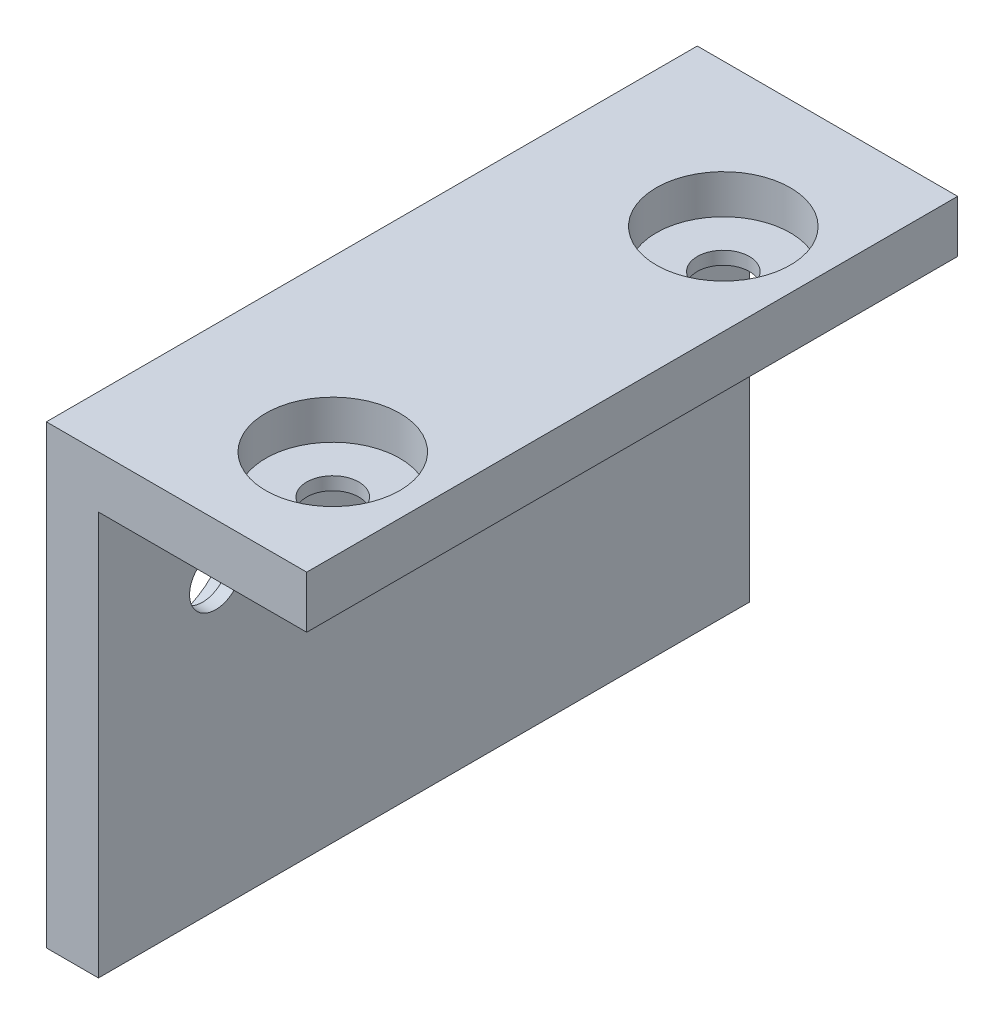
ISO-10303-21;
HEADER;
FILE_DESCRIPTION(('STEP AP214'),'2;1');
FILE_NAME('part.step','',(''),(''),'','','');
FILE_SCHEMA(('AUTOMOTIVE_DESIGN { 1 0 10303 214 1 1 1 1 }'));
ENDSEC;
DATA;
#1=APPLICATION_CONTEXT('core data for automotive mechanical design processes');
#2=APPLICATION_PROTOCOL_DEFINITION('international standard','automotive_design',2000,#1);
#3=PRODUCT_CONTEXT('',#1,'mechanical');
#4=PRODUCT('Part','Part','',(#3));
#5=PRODUCT_RELATED_PRODUCT_CATEGORY('part','',(#4));
#6=PRODUCT_DEFINITION_FORMATION('','',#4);
#7=PRODUCT_DEFINITION_CONTEXT('part definition',#1,'design');
#8=PRODUCT_DEFINITION('design','',#6,#7);
#9=PRODUCT_DEFINITION_SHAPE('','',#8);
#10=(LENGTH_UNIT() NAMED_UNIT(*) SI_UNIT(.MILLI.,.METRE.));
#11=(NAMED_UNIT(*) PLANE_ANGLE_UNIT() SI_UNIT($,.RADIAN.));
#12=(NAMED_UNIT(*) SI_UNIT($,.STERADIAN.) SOLID_ANGLE_UNIT());
#13=UNCERTAINTY_MEASURE_WITH_UNIT(LENGTH_MEASURE(1.E-05),#10,'distance_accuracy_value','');
#14=(GEOMETRIC_REPRESENTATION_CONTEXT(3) GLOBAL_UNCERTAINTY_ASSIGNED_CONTEXT((#13)) GLOBAL_UNIT_ASSIGNED_CONTEXT((#10,
#11,#12)) REPRESENTATION_CONTEXT('',''));
#15=CARTESIAN_POINT('',(0.,0.,0.));
#16=DIRECTION('',(0.,0.,1.));
#17=DIRECTION('',(1.,0.,0.));
#18=AXIS2_PLACEMENT_3D('',#15,#16,#17);
#19=CARTESIAN_POINT('',(0.,-31.,50.));
#20=DIRECTION('',(-1.,0.,0.));
#21=DIRECTION('',(0.,-1.,0.));
#22=AXIS2_PLACEMENT_3D('',#19,#20,#21);
#23=PLANE('',#22);
#24=CARTESIAN_POINT('',(0.,-9.00000000000001,41.));
#25=DIRECTION('',(-1.,0.,0.));
#26=DIRECTION('',(0.,-1.,0.));
#27=AXIS2_PLACEMENT_3D('',#24,#25,#26);
#28=CIRCLE('',#27,2.);
#29=CARTESIAN_POINT('',(0.,-11.,41.));
#30=VERTEX_POINT('',#29);
#31=EDGE_CURVE('E164',#30,#30,#28,.T.);
#32=ORIENTED_EDGE('',*,*,#31,.T.);
#33=EDGE_LOOP('',(#32));
#34=FACE_BOUND('',#33,.T.);
#35=CARTESIAN_POINT('',(0.,-9.00000000000001,11.));
#36=DIRECTION('',(-1.,0.,0.));
#37=DIRECTION('',(0.,-1.,0.));
#38=AXIS2_PLACEMENT_3D('',#35,#36,#37);
#39=CIRCLE('',#38,2.);
#40=CARTESIAN_POINT('',(0.,-11.,11.));
#41=VERTEX_POINT('',#40);
#42=EDGE_CURVE('E167',#41,#41,#39,.T.);
#43=ORIENTED_EDGE('',*,*,#42,.T.);
#44=EDGE_LOOP('',(#43));
#45=FACE_BOUND('',#44,.T.);
#46=DIRECTION('',(0.,1.,0.));
#47=VECTOR('',#46,1.);
#48=CARTESIAN_POINT('',(0.,-31.,0.));
#49=LINE('',#48,#47);
#50=CARTESIAN_POINT('',(0.,-31.,0.));
#51=VERTEX_POINT('',#50);
#52=CARTESIAN_POINT('',(0.,0.,0.));
#53=VERTEX_POINT('',#52);
#54=EDGE_CURVE('E117',#51,#53,#49,.T.);
#55=ORIENTED_EDGE('',*,*,#54,.T.);
#56=DIRECTION('',(0.,0.,-1.));
#57=VECTOR('',#56,1.);
#58=CARTESIAN_POINT('',(0.,0.,50.));
#59=LINE('',#58,#57);
#60=CARTESIAN_POINT('',(0.,0.,50.));
#61=VERTEX_POINT('',#60);
#62=EDGE_CURVE('E11',#61,#53,#59,.T.);
#63=ORIENTED_EDGE('',*,*,#62,.F.);
#64=DIRECTION('',(0.,1.,0.));
#65=VECTOR('',#64,1.);
#66=CARTESIAN_POINT('',(0.,-31.,50.));
#67=LINE('',#66,#65);
#68=CARTESIAN_POINT('',(0.,-31.,50.));
#69=VERTEX_POINT('',#68);
#70=EDGE_CURVE('E128',#69,#61,#67,.T.);
#71=ORIENTED_EDGE('',*,*,#70,.F.);
#72=DIRECTION('',(0.,0.,-1.));
#73=VECTOR('',#72,1.);
#74=CARTESIAN_POINT('',(0.,-31.,50.));
#75=LINE('',#74,#73);
#76=EDGE_CURVE('E113',#69,#51,#75,.T.);
#77=ORIENTED_EDGE('',*,*,#76,.T.);
#78=EDGE_LOOP('',(#55,#63,#71,#77));
#79=FACE_BOUND('',#78,.T.);
#80=ADVANCED_FACE('F33',(#34,#45,#79),#23,.F.);
#81=CARTESIAN_POINT('',(0.,0.,50.));
#82=DIRECTION('',(0.,1.,0.));
#83=DIRECTION('',(0.,0.,1.));
#84=AXIS2_PLACEMENT_3D('',#81,#82,#83);
#85=PLANE('',#84);
#86=CARTESIAN_POINT('',(9.00000000000001,0.,41.));
#87=DIRECTION('',(0.,1.,0.));
#88=DIRECTION('',(0.,0.,1.));
#89=AXIS2_PLACEMENT_3D('',#86,#87,#88);
#90=CIRCLE('',#89,2.);
#91=CARTESIAN_POINT('',(9.00000000000001,0.,43.));
#92=VERTEX_POINT('',#91);
#93=EDGE_CURVE('E396',#92,#92,#90,.T.);
#94=ORIENTED_EDGE('',*,*,#93,.T.);
#95=EDGE_LOOP('',(#94));
#96=FACE_BOUND('',#95,.T.);
#97=CARTESIAN_POINT('',(9.00000000000001,0.,11.));
#98=DIRECTION('',(0.,1.,0.));
#99=DIRECTION('',(0.,0.,1.));
#100=AXIS2_PLACEMENT_3D('',#97,#98,#99);
#101=CIRCLE('',#100,2.);
#102=CARTESIAN_POINT('',(9.00000000000001,0.,13.));
#103=VERTEX_POINT('',#102);
#104=EDGE_CURVE('E388',#103,#103,#101,.T.);
#105=ORIENTED_EDGE('',*,*,#104,.T.);
#106=EDGE_LOOP('',(#105));
#107=FACE_BOUND('',#106,.T.);
#108=DIRECTION('',(1.,0.,0.));
#109=VECTOR('',#108,1.);
#110=CARTESIAN_POINT('',(0.,0.,0.));
#111=LINE('',#110,#109);
#112=CARTESIAN_POINT('',(16.,0.,0.));
#113=VERTEX_POINT('',#112);
#114=EDGE_CURVE('E120',#53,#113,#111,.T.);
#115=ORIENTED_EDGE('',*,*,#114,.T.);
#116=DIRECTION('',(0.,0.,-1.));
#117=VECTOR('',#116,1.);
#118=CARTESIAN_POINT('',(16.,0.,50.));
#119=LINE('',#118,#117);
#120=CARTESIAN_POINT('',(16.,0.,50.));
#121=VERTEX_POINT('',#120);
#122=EDGE_CURVE('E41',#121,#113,#119,.T.);
#123=ORIENTED_EDGE('',*,*,#122,.F.);
#124=DIRECTION('',(1.,0.,0.));
#125=VECTOR('',#124,1.);
#126=CARTESIAN_POINT('',(0.,0.,50.));
#127=LINE('',#126,#125);
#128=EDGE_CURVE('E86',#61,#121,#127,.T.);
#129=ORIENTED_EDGE('',*,*,#128,.F.);
#130=ORIENTED_EDGE('',*,*,#62,.T.);
#131=EDGE_LOOP('',(#115,#123,#129,#130));
#132=FACE_BOUND('',#131,.T.);
#133=ADVANCED_FACE('F153',(#96,#107,#132),#85,.F.);
#134=CARTESIAN_POINT('',(16.,0.,50.));
#135=DIRECTION('',(-1.,0.,0.));
#136=DIRECTION('',(0.,-1.,0.));
#137=AXIS2_PLACEMENT_3D('',#134,#135,#136);
#138=PLANE('',#137);
#139=DIRECTION('',(0.,1.,0.));
#140=VECTOR('',#139,1.);
#141=CARTESIAN_POINT('',(16.,0.,0.));
#142=LINE('',#141,#140);
#143=CARTESIAN_POINT('',(16.,4.,0.));
#144=VERTEX_POINT('',#143);
#145=EDGE_CURVE('E123',#113,#144,#142,.T.);
#146=ORIENTED_EDGE('',*,*,#145,.T.);
#147=DIRECTION('',(0.,0.,-1.));
#148=VECTOR('',#147,1.);
#149=CARTESIAN_POINT('',(16.,4.,50.));
#150=LINE('',#149,#148);
#151=CARTESIAN_POINT('',(16.,4.,50.));
#152=VERTEX_POINT('',#151);
#153=EDGE_CURVE('E108',#152,#144,#150,.T.);
#154=ORIENTED_EDGE('',*,*,#153,.F.);
#155=DIRECTION('',(0.,1.,0.));
#156=VECTOR('',#155,1.);
#157=CARTESIAN_POINT('',(16.,0.,50.));
#158=LINE('',#157,#156);
#159=EDGE_CURVE('E99',#121,#152,#158,.T.);
#160=ORIENTED_EDGE('',*,*,#159,.F.);
#161=ORIENTED_EDGE('',*,*,#122,.T.);
#162=EDGE_LOOP('',(#146,#154,#160,#161));
#163=FACE_BOUND('',#162,.T.);
#164=ADVANCED_FACE('F134',(#163),#138,.F.);
#165=CARTESIAN_POINT('',(16.,4.,50.));
#166=DIRECTION('',(0.,-1.,0.));
#167=DIRECTION('',(1.,0.,0.));
#168=AXIS2_PLACEMENT_3D('',#165,#166,#167);
#169=PLANE('',#168);
#170=CARTESIAN_POINT('',(9.00000000000001,4.,41.));
#171=DIRECTION('',(0.,1.,0.));
#172=DIRECTION('',(1.,0.,0.));
#173=AXIS2_PLACEMENT_3D('',#170,#171,#172);
#174=CIRCLE('',#173,5.15000000000001);
#175=CARTESIAN_POINT('',(14.15,4.,41.));
#176=VERTEX_POINT('',#175);
#177=EDGE_CURVE('E185',#176,#176,#174,.T.);
#178=ORIENTED_EDGE('',*,*,#177,.F.);
#179=EDGE_LOOP('',(#178));
#180=FACE_BOUND('',#179,.T.);
#181=CARTESIAN_POINT('',(9.00000000000001,4.,11.));
#182=DIRECTION('',(0.,1.,0.));
#183=DIRECTION('',(-1.,0.,0.));
#184=AXIS2_PLACEMENT_3D('',#181,#182,#183);
#185=CIRCLE('',#184,5.15000000000001);
#186=CARTESIAN_POINT('',(3.84999999999999,4.,11.));
#187=VERTEX_POINT('',#186);
#188=EDGE_CURVE('E191',#187,#187,#185,.T.);
#189=ORIENTED_EDGE('',*,*,#188,.F.);
#190=EDGE_LOOP('',(#189));
#191=FACE_BOUND('',#190,.T.);
#192=DIRECTION('',(-1.,0.,0.));
#193=VECTOR('',#192,1.);
#194=CARTESIAN_POINT('',(16.,4.,0.));
#195=LINE('',#194,#193);
#196=CARTESIAN_POINT('',(-4.,3.99999999999999,0.));
#197=VERTEX_POINT('',#196);
#198=EDGE_CURVE('E107',#144,#197,#195,.T.);
#199=ORIENTED_EDGE('',*,*,#198,.T.);
#200=DIRECTION('',(0.,0.,-1.));
#201=VECTOR('',#200,1.);
#202=CARTESIAN_POINT('',(-4.,3.99999999999999,50.));
#203=LINE('',#202,#201);
#204=CARTESIAN_POINT('',(-4.,3.99999999999999,50.));
#205=VERTEX_POINT('',#204);
#206=EDGE_CURVE('E104',#205,#197,#203,.T.);
#207=ORIENTED_EDGE('',*,*,#206,.F.);
#208=DIRECTION('',(-1.,0.,0.));
#209=VECTOR('',#208,1.);
#210=CARTESIAN_POINT('',(16.,4.,50.));
#211=LINE('',#210,#209);
#212=EDGE_CURVE('E93',#152,#205,#211,.T.);
#213=ORIENTED_EDGE('',*,*,#212,.F.);
#214=ORIENTED_EDGE('',*,*,#153,.T.);
#215=EDGE_LOOP('',(#199,#207,#213,#214));
#216=FACE_BOUND('',#215,.T.);
#217=ADVANCED_FACE('F105',(#180,#191,#216),#169,.F.);
#218=CARTESIAN_POINT('',(-4.,3.99999999999999,50.));
#219=DIRECTION('',(1.,0.,0.));
#220=DIRECTION('',(0.,1.,0.));
#221=AXIS2_PLACEMENT_3D('',#218,#219,#220);
#222=PLANE('',#221);
#223=CARTESIAN_POINT('',(-4.,-9.00000000000001,41.));
#224=DIRECTION('',(-1.,0.,0.));
#225=DIRECTION('',(0.,1.,0.));
#226=AXIS2_PLACEMENT_3D('',#223,#224,#225);
#227=CIRCLE('',#226,5.15000000000001);
#228=CARTESIAN_POINT('',(-4.,-3.84999999999999,41.));
#229=VERTEX_POINT('',#228);
#230=EDGE_CURVE('E169',#229,#229,#227,.T.);
#231=ORIENTED_EDGE('',*,*,#230,.F.);
#232=EDGE_LOOP('',(#231));
#233=FACE_BOUND('',#232,.T.);
#234=CARTESIAN_POINT('',(-4.,-9.00000000000001,11.));
#235=DIRECTION('',(-1.,0.,0.));
#236=DIRECTION('',(0.,-1.,0.));
#237=AXIS2_PLACEMENT_3D('',#234,#235,#236);
#238=CIRCLE('',#237,5.15000000000001);
#239=CARTESIAN_POINT('',(-4.,-14.15,11.));
#240=VERTEX_POINT('',#239);
#241=EDGE_CURVE('E180',#240,#240,#238,.T.);
#242=ORIENTED_EDGE('',*,*,#241,.F.);
#243=EDGE_LOOP('',(#242));
#244=FACE_BOUND('',#243,.T.);
#245=DIRECTION('',(0.,-1.,0.));
#246=VECTOR('',#245,1.);
#247=CARTESIAN_POINT('',(-4.,3.99999999999999,0.));
#248=LINE('',#247,#246);
#249=CARTESIAN_POINT('',(-4.,-31.,0.));
#250=VERTEX_POINT('',#249);
#251=EDGE_CURVE('E72',#197,#250,#248,.T.);
#252=ORIENTED_EDGE('',*,*,#251,.T.);
#253=DIRECTION('',(0.,0.,-1.));
#254=VECTOR('',#253,1.);
#255=CARTESIAN_POINT('',(-4.,-31.,50.));
#256=LINE('',#255,#254);
#257=CARTESIAN_POINT('',(-4.,-31.,50.));
#258=VERTEX_POINT('',#257);
#259=EDGE_CURVE('E109',#258,#250,#256,.T.);
#260=ORIENTED_EDGE('',*,*,#259,.F.);
#261=DIRECTION('',(0.,-1.,0.));
#262=VECTOR('',#261,1.);
#263=CARTESIAN_POINT('',(-4.,3.99999999999999,50.));
#264=LINE('',#263,#262);
#265=EDGE_CURVE('E97',#205,#258,#264,.T.);
#266=ORIENTED_EDGE('',*,*,#265,.F.);
#267=ORIENTED_EDGE('',*,*,#206,.T.);
#268=EDGE_LOOP('',(#252,#260,#266,#267));
#269=FACE_BOUND('',#268,.T.);
#270=ADVANCED_FACE('F111',(#233,#244,#269),#222,.F.);
#271=CARTESIAN_POINT('',(-4.,-31.,50.));
#272=DIRECTION('',(0.,1.,0.));
#273=DIRECTION('',(0.,0.,1.));
#274=AXIS2_PLACEMENT_3D('',#271,#272,#273);
#275=PLANE('',#274);
#276=DIRECTION('',(1.,0.,0.));
#277=VECTOR('',#276,1.);
#278=CARTESIAN_POINT('',(-4.,-31.,0.));
#279=LINE('',#278,#277);
#280=EDGE_CURVE('E78',#250,#51,#279,.T.);
#281=ORIENTED_EDGE('',*,*,#280,.T.);
#282=ORIENTED_EDGE('',*,*,#76,.F.);
#283=DIRECTION('',(1.,0.,0.));
#284=VECTOR('',#283,1.);
#285=CARTESIAN_POINT('',(-4.,-31.,50.));
#286=LINE('',#285,#284);
#287=EDGE_CURVE('E49',#258,#69,#286,.T.);
#288=ORIENTED_EDGE('',*,*,#287,.F.);
#289=ORIENTED_EDGE('',*,*,#259,.T.);
#290=EDGE_LOOP('',(#281,#282,#288,#289));
#291=FACE_BOUND('',#290,.T.);
#292=ADVANCED_FACE('F141',(#291),#275,.F.);
#293=CARTESIAN_POINT('',(0.,0.,50.));
#294=DIRECTION('',(0.,0.,-1.));
#295=DIRECTION('',(-1.,0.,0.));
#296=AXIS2_PLACEMENT_3D('',#293,#294,#295);
#297=PLANE('',#296);
#298=ORIENTED_EDGE('',*,*,#70,.T.);
#299=ORIENTED_EDGE('',*,*,#128,.T.);
#300=ORIENTED_EDGE('',*,*,#159,.T.);
#301=ORIENTED_EDGE('',*,*,#212,.T.);
#302=ORIENTED_EDGE('',*,*,#265,.T.);
#303=ORIENTED_EDGE('',*,*,#287,.T.);
#304=EDGE_LOOP('',(#298,#299,#300,#301,#302,#303));
#305=FACE_BOUND('',#304,.T.);
#306=ADVANCED_FACE('F95',(#305),#297,.F.);
#307=CARTESIAN_POINT('',(0.,0.,0.));
#308=DIRECTION('',(0.,0.,-1.));
#309=DIRECTION('',(-1.,0.,0.));
#310=AXIS2_PLACEMENT_3D('',#307,#308,#309);
#311=PLANE('',#310);
#312=ORIENTED_EDGE('',*,*,#54,.F.);
#313=ORIENTED_EDGE('',*,*,#280,.F.);
#314=ORIENTED_EDGE('',*,*,#251,.F.);
#315=ORIENTED_EDGE('',*,*,#198,.F.);
#316=ORIENTED_EDGE('',*,*,#145,.F.);
#317=ORIENTED_EDGE('',*,*,#114,.F.);
#318=EDGE_LOOP('',(#312,#313,#314,#315,#316,#317));
#319=FACE_BOUND('',#318,.T.);
#320=ADVANCED_FACE('F137',(#319),#311,.T.);
#321=CARTESIAN_POINT('',(9.00000000000001,0.999999999999997,11.));
#322=DIRECTION('',(0.,1.,0.));
#323=DIRECTION('',(-1.,0.,0.));
#324=AXIS2_PLACEMENT_3D('',#321,#322,#323);
#325=CYLINDRICAL_SURFACE('',#324,5.15000000000001);
#326=CARTESIAN_POINT('',(9.00000000000001,0.999999999999997,11.));
#327=DIRECTION('',(0.,1.,0.));
#328=DIRECTION('',(-1.,0.,0.));
#329=AXIS2_PLACEMENT_3D('',#326,#327,#328);
#330=CIRCLE('',#329,5.15000000000001);
#331=CARTESIAN_POINT('',(3.84999999999999,0.999999999999996,11.));
#332=VERTEX_POINT('',#331);
#333=EDGE_CURVE('E121',#332,#332,#330,.T.);
#334=ORIENTED_EDGE('',*,*,#333,.F.);
#335=EDGE_LOOP('',(#334));
#336=FACE_BOUND('',#335,.T.);
#337=ORIENTED_EDGE('',*,*,#188,.T.);
#338=EDGE_LOOP('',(#337));
#339=FACE_BOUND('',#338,.T.);
#340=ADVANCED_FACE('F201',(#336,#339),#325,.F.);
#341=CARTESIAN_POINT('',(9.00000000000001,0.999999999999997,11.));
#342=DIRECTION('',(0.,1.,0.));
#343=DIRECTION('',(-1.,0.,0.));
#344=AXIS2_PLACEMENT_3D('',#341,#342,#343);
#345=PLANE('',#344);
#346=CARTESIAN_POINT('',(9.00000000000001,0.999999999999997,11.));
#347=DIRECTION('',(0.,1.,0.));
#348=DIRECTION('',(-1.,0.,0.));
#349=AXIS2_PLACEMENT_3D('',#346,#347,#348);
#350=CIRCLE('',#349,2.);
#351=CARTESIAN_POINT('',(7.,0.999999999999996,11.));
#352=VERTEX_POINT('',#351);
#353=EDGE_CURVE('E391',#352,#352,#350,.T.);
#354=ORIENTED_EDGE('',*,*,#353,.F.);
#355=EDGE_LOOP('',(#354));
#356=FACE_BOUND('',#355,.T.);
#357=ORIENTED_EDGE('',*,*,#333,.T.);
#358=EDGE_LOOP('',(#357));
#359=FACE_BOUND('',#358,.T.);
#360=ADVANCED_FACE('F215',(#356,#359),#345,.T.);
#361=CARTESIAN_POINT('',(9.00000000000001,0.999999999999997,41.));
#362=DIRECTION('',(0.,1.,0.));
#363=DIRECTION('',(-1.,0.,0.));
#364=AXIS2_PLACEMENT_3D('',#361,#362,#363);
#365=CYLINDRICAL_SURFACE('',#364,5.15000000000001);
#366=CARTESIAN_POINT('',(9.00000000000001,0.999999999999997,41.));
#367=DIRECTION('',(0.,1.,0.));
#368=DIRECTION('',(1.,0.,0.));
#369=AXIS2_PLACEMENT_3D('',#366,#367,#368);
#370=CIRCLE('',#369,5.15000000000001);
#371=CARTESIAN_POINT('',(14.15,0.999999999999997,41.));
#372=VERTEX_POINT('',#371);
#373=EDGE_CURVE('E188',#372,#372,#370,.T.);
#374=ORIENTED_EDGE('',*,*,#373,.F.);
#375=EDGE_LOOP('',(#374));
#376=FACE_BOUND('',#375,.T.);
#377=ORIENTED_EDGE('',*,*,#177,.T.);
#378=EDGE_LOOP('',(#377));
#379=FACE_BOUND('',#378,.T.);
#380=ADVANCED_FACE('F212',(#376,#379),#365,.F.);
#381=CARTESIAN_POINT('',(9.00000000000001,0.999999999999997,41.));
#382=DIRECTION('',(0.,-1.,0.));
#383=DIRECTION('',(1.,0.,0.));
#384=AXIS2_PLACEMENT_3D('',#381,#382,#383);
#385=PLANE('',#384);
#386=CARTESIAN_POINT('',(9.00000000000001,0.999999999999997,41.));
#387=DIRECTION('',(0.,1.,0.));
#388=DIRECTION('',(-1.,0.,0.));
#389=AXIS2_PLACEMENT_3D('',#386,#387,#388);
#390=CIRCLE('',#389,2.);
#391=CARTESIAN_POINT('',(7.,0.999999999999996,41.));
#392=VERTEX_POINT('',#391);
#393=EDGE_CURVE('E399',#392,#392,#390,.T.);
#394=ORIENTED_EDGE('',*,*,#393,.F.);
#395=EDGE_LOOP('',(#394));
#396=FACE_BOUND('',#395,.T.);
#397=ORIENTED_EDGE('',*,*,#373,.T.);
#398=EDGE_LOOP('',(#397));
#399=FACE_BOUND('',#398,.T.);
#400=ADVANCED_FACE('F214',(#396,#399),#385,.F.);
#401=CARTESIAN_POINT('',(-0.999999999999998,-9.00000000000001,11.));
#402=DIRECTION('',(-1.,0.,0.));
#403=DIRECTION('',(0.,-1.,0.));
#404=AXIS2_PLACEMENT_3D('',#401,#402,#403);
#405=CYLINDRICAL_SURFACE('',#404,5.15000000000001);
#406=CARTESIAN_POINT('',(-0.999999999999998,-9.00000000000001,11.));
#407=DIRECTION('',(-1.,0.,0.));
#408=DIRECTION('',(0.,-1.,0.));
#409=AXIS2_PLACEMENT_3D('',#406,#407,#408);
#410=CIRCLE('',#409,5.15000000000001);
#411=CARTESIAN_POINT('',(-0.999999999999999,-14.15,11.));
#412=VERTEX_POINT('',#411);
#413=EDGE_CURVE('E182',#412,#412,#410,.T.);
#414=ORIENTED_EDGE('',*,*,#413,.F.);
#415=EDGE_LOOP('',(#414));
#416=FACE_BOUND('',#415,.T.);
#417=ORIENTED_EDGE('',*,*,#241,.T.);
#418=EDGE_LOOP('',(#417));
#419=FACE_BOUND('',#418,.T.);
#420=ADVANCED_FACE('F223',(#416,#419),#405,.F.);
#421=CARTESIAN_POINT('',(-0.999999999999998,-9.00000000000001,11.));
#422=DIRECTION('',(-1.,0.,0.));
#423=DIRECTION('',(0.,-1.,0.));
#424=AXIS2_PLACEMENT_3D('',#421,#422,#423);
#425=PLANE('',#424);
#426=CARTESIAN_POINT('',(-0.999999999999998,-9.00000000000001,11.));
#427=DIRECTION('',(-1.,0.,0.));
#428=DIRECTION('',(0.,-1.,0.));
#429=AXIS2_PLACEMENT_3D('',#426,#427,#428);
#430=CIRCLE('',#429,2.);
#431=CARTESIAN_POINT('',(-0.999999999999999,-11.,11.));
#432=VERTEX_POINT('',#431);
#433=EDGE_CURVE('E170',#432,#432,#430,.T.);
#434=ORIENTED_EDGE('',*,*,#433,.F.);
#435=EDGE_LOOP('',(#434));
#436=FACE_BOUND('',#435,.T.);
#437=ORIENTED_EDGE('',*,*,#413,.T.);
#438=EDGE_LOOP('',(#437));
#439=FACE_BOUND('',#438,.T.);
#440=ADVANCED_FACE('F297',(#436,#439),#425,.T.);
#441=CARTESIAN_POINT('',(-0.999999999999998,-9.00000000000001,41.));
#442=DIRECTION('',(-1.,0.,0.));
#443=DIRECTION('',(0.,-1.,0.));
#444=AXIS2_PLACEMENT_3D('',#441,#442,#443);
#445=CYLINDRICAL_SURFACE('',#444,5.15000000000001);
#446=CARTESIAN_POINT('',(-0.999999999999998,-9.00000000000001,41.));
#447=DIRECTION('',(-1.,0.,0.));
#448=DIRECTION('',(0.,1.,0.));
#449=AXIS2_PLACEMENT_3D('',#446,#447,#448);
#450=CIRCLE('',#449,5.15000000000001);
#451=CARTESIAN_POINT('',(-0.999999999999997,-3.84999999999999,41.));
#452=VERTEX_POINT('',#451);
#453=EDGE_CURVE('E173',#452,#452,#450,.T.);
#454=ORIENTED_EDGE('',*,*,#453,.F.);
#455=EDGE_LOOP('',(#454));
#456=FACE_BOUND('',#455,.T.);
#457=ORIENTED_EDGE('',*,*,#230,.T.);
#458=EDGE_LOOP('',(#457));
#459=FACE_BOUND('',#458,.T.);
#460=ADVANCED_FACE('F293',(#456,#459),#445,.F.);
#461=CARTESIAN_POINT('',(-0.999999999999998,-9.00000000000001,41.));
#462=DIRECTION('',(1.,0.,0.));
#463=DIRECTION('',(0.,1.,0.));
#464=AXIS2_PLACEMENT_3D('',#461,#462,#463);
#465=PLANE('',#464);
#466=CARTESIAN_POINT('',(-0.999999999999998,-9.00000000000001,41.));
#467=DIRECTION('',(-1.,0.,0.));
#468=DIRECTION('',(0.,-1.,0.));
#469=AXIS2_PLACEMENT_3D('',#466,#467,#468);
#470=CIRCLE('',#469,2.);
#471=CARTESIAN_POINT('',(-0.999999999999999,-11.,41.));
#472=VERTEX_POINT('',#471);
#473=EDGE_CURVE('E387',#472,#472,#470,.T.);
#474=ORIENTED_EDGE('',*,*,#473,.F.);
#475=EDGE_LOOP('',(#474));
#476=FACE_BOUND('',#475,.T.);
#477=ORIENTED_EDGE('',*,*,#453,.T.);
#478=EDGE_LOOP('',(#477));
#479=FACE_BOUND('',#478,.T.);
#480=ADVANCED_FACE('F289',(#476,#479),#465,.F.);
#481=CARTESIAN_POINT('',(9.,-9.00000000000001,11.));
#482=DIRECTION('',(-1.,0.,0.));
#483=DIRECTION('',(0.,-1.,0.));
#484=AXIS2_PLACEMENT_3D('',#481,#482,#483);
#485=CYLINDRICAL_SURFACE('',#484,2.);
#486=ORIENTED_EDGE('',*,*,#433,.T.);
#487=EDGE_LOOP('',(#486));
#488=FACE_BOUND('',#487,.T.);
#489=ORIENTED_EDGE('',*,*,#42,.F.);
#490=EDGE_LOOP('',(#489));
#491=FACE_BOUND('',#490,.T.);
#492=ADVANCED_FACE('F285',(#488,#491),#485,.F.);
#493=CARTESIAN_POINT('',(9.,-9.00000000000001,41.));
#494=DIRECTION('',(-1.,0.,0.));
#495=DIRECTION('',(0.,-1.,0.));
#496=AXIS2_PLACEMENT_3D('',#493,#494,#495);
#497=CYLINDRICAL_SURFACE('',#496,2.);
#498=ORIENTED_EDGE('',*,*,#473,.T.);
#499=EDGE_LOOP('',(#498));
#500=FACE_BOUND('',#499,.T.);
#501=ORIENTED_EDGE('',*,*,#31,.F.);
#502=EDGE_LOOP('',(#501));
#503=FACE_BOUND('',#502,.T.);
#504=ADVANCED_FACE('F265',(#500,#503),#497,.F.);
#505=CARTESIAN_POINT('',(9.00000000000001,-9.00000000000001,11.));
#506=DIRECTION('',(0.,1.,0.));
#507=DIRECTION('',(-1.,0.,0.));
#508=AXIS2_PLACEMENT_3D('',#505,#506,#507);
#509=CYLINDRICAL_SURFACE('',#508,2.);
#510=ORIENTED_EDGE('',*,*,#353,.T.);
#511=EDGE_LOOP('',(#510));
#512=FACE_BOUND('',#511,.T.);
#513=ORIENTED_EDGE('',*,*,#104,.F.);
#514=EDGE_LOOP('',(#513));
#515=FACE_BOUND('',#514,.T.);
#516=ADVANCED_FACE('F259',(#512,#515),#509,.F.);
#517=CARTESIAN_POINT('',(9.00000000000001,-9.00000000000001,41.));
#518=DIRECTION('',(0.,1.,0.));
#519=DIRECTION('',(-1.,0.,0.));
#520=AXIS2_PLACEMENT_3D('',#517,#518,#519);
#521=CYLINDRICAL_SURFACE('',#520,2.);
#522=ORIENTED_EDGE('',*,*,#393,.T.);
#523=EDGE_LOOP('',(#522));
#524=FACE_BOUND('',#523,.T.);
#525=ORIENTED_EDGE('',*,*,#93,.F.);
#526=EDGE_LOOP('',(#525));
#527=FACE_BOUND('',#526,.T.);
#528=ADVANCED_FACE('F264',(#524,#527),#521,.F.);
#529=CLOSED_SHELL('',(#80,#133,#164,#217,#270,#292,#306,#320,#340,#360,#380,#400,#420,#440,#460,
#480,#492,#504,#516,#528));
#530=MANIFOLD_SOLID_BREP('B2',#529);
#531=ADVANCED_BREP_SHAPE_REPRESENTATION('',(#18,#530),#14);
#532=SHAPE_DEFINITION_REPRESENTATION(#9,#531);
ENDSEC;
END-ISO-10303-21;
